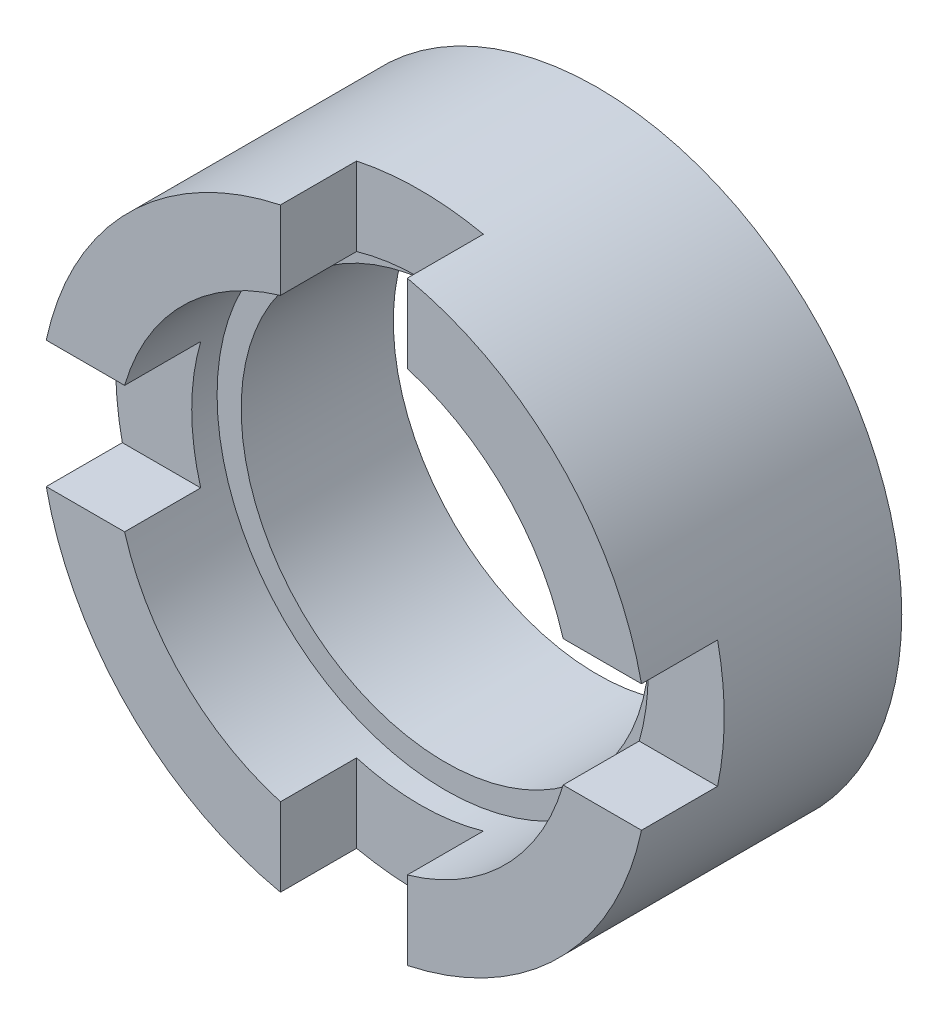
ISO-10303-21;
HEADER;
FILE_DESCRIPTION(('STEP AP214'),'2;1');
FILE_NAME('part.step','',(''),(''),'','','');
FILE_SCHEMA(('AUTOMOTIVE_DESIGN { 1 0 10303 214 1 1 1 1 }'));
ENDSEC;
DATA;
#1=APPLICATION_CONTEXT('core data for automotive mechanical design processes');
#2=APPLICATION_PROTOCOL_DEFINITION('international standard','automotive_design',2000,#1);
#3=PRODUCT_CONTEXT('',#1,'mechanical');
#4=PRODUCT('Part','Part','',(#3));
#5=PRODUCT_RELATED_PRODUCT_CATEGORY('part','',(#4));
#6=PRODUCT_DEFINITION_FORMATION('','',#4);
#7=PRODUCT_DEFINITION_CONTEXT('part definition',#1,'design');
#8=PRODUCT_DEFINITION('design','',#6,#7);
#9=PRODUCT_DEFINITION_SHAPE('','',#8);
#10=(LENGTH_UNIT() NAMED_UNIT(*) SI_UNIT(.MILLI.,.METRE.));
#11=(NAMED_UNIT(*) PLANE_ANGLE_UNIT() SI_UNIT($,.RADIAN.));
#12=(NAMED_UNIT(*) SI_UNIT($,.STERADIAN.) SOLID_ANGLE_UNIT());
#13=UNCERTAINTY_MEASURE_WITH_UNIT(LENGTH_MEASURE(1.E-05),#10,'distance_accuracy_value','');
#14=(GEOMETRIC_REPRESENTATION_CONTEXT(3) GLOBAL_UNCERTAINTY_ASSIGNED_CONTEXT((#13)) GLOBAL_UNIT_ASSIGNED_CONTEXT((#10,
#11,#12)) REPRESENTATION_CONTEXT('',''));
#15=CARTESIAN_POINT('',(0.,0.,0.));
#16=DIRECTION('',(0.,0.,1.));
#17=DIRECTION('',(1.,0.,0.));
#18=AXIS2_PLACEMENT_3D('',#15,#16,#17);
#19=CARTESIAN_POINT('',(0.,0.,10.));
#20=DIRECTION('',(0.,0.,-1.));
#21=DIRECTION('',(-1.,0.,0.));
#22=AXIS2_PLACEMENT_3D('',#19,#20,#21);
#23=CYLINDRICAL_SURFACE('',#22,8.05);
#24=CARTESIAN_POINT('',(0.,0.,0.));
#25=DIRECTION('',(0.,0.,1.));
#26=DIRECTION('',(1.,0.,0.));
#27=AXIS2_PLACEMENT_3D('',#24,#25,#26);
#28=CIRCLE('',#27,8.05);
#29=CARTESIAN_POINT('',(8.05,0.,0.));
#30=VERTEX_POINT('',#29);
#31=EDGE_CURVE('E222',#30,#30,#28,.T.);
#32=ORIENTED_EDGE('',*,*,#31,.F.);
#33=EDGE_LOOP('',(#32));
#34=FACE_BOUND('',#33,.T.);
#35=CARTESIAN_POINT('',(0.,0.,6.));
#36=DIRECTION('',(0.,0.,1.));
#37=DIRECTION('',(1.,0.,0.));
#38=AXIS2_PLACEMENT_3D('',#35,#36,#37);
#39=CIRCLE('',#38,8.05);
#40=CARTESIAN_POINT('',(8.05,0.,6.));
#41=VERTEX_POINT('',#40);
#42=EDGE_CURVE('E47',#41,#41,#39,.T.);
#43=ORIENTED_EDGE('',*,*,#42,.T.);
#44=EDGE_LOOP('',(#43));
#45=FACE_BOUND('',#44,.T.);
#46=ADVANCED_FACE('F43',(#34,#45),#23,.F.);
#47=CARTESIAN_POINT('',(0.,0.,10.));
#48=DIRECTION('',(0.,0.,1.));
#49=DIRECTION('',(1.,0.,0.));
#50=AXIS2_PLACEMENT_3D('',#47,#48,#49);
#51=PLANE('',#50);
#52=CARTESIAN_POINT('',(0.,0.,10.));
#53=DIRECTION('',(0.,0.,1.));
#54=DIRECTION('',(1.,0.,0.));
#55=AXIS2_PLACEMENT_3D('',#52,#53,#54);
#56=CIRCLE('',#55,9.);
#57=CARTESIAN_POINT('',(-2.5,8.64580823289529,10.));
#58=VERTEX_POINT('',#57);
#59=CARTESIAN_POINT('',(-8.64580823289529,2.5,10.));
#60=VERTEX_POINT('',#59);
#61=EDGE_CURVE('E176',#58,#60,#56,.T.);
#62=ORIENTED_EDGE('',*,*,#61,.F.);
#63=DIRECTION('',(0.,-1.,0.));
#64=VECTOR('',#63,1.);
#65=CARTESIAN_POINT('',(-2.5,16.5,10.));
#66=LINE('',#65,#64);
#67=CARTESIAN_POINT('',(-2.5,11.7366945943055,10.));
#68=VERTEX_POINT('',#67);
#69=EDGE_CURVE('E184',#68,#58,#66,.T.);
#70=ORIENTED_EDGE('',*,*,#69,.F.);
#71=CARTESIAN_POINT('',(0.,0.,10.));
#72=DIRECTION('',(0.,0.,1.));
#73=DIRECTION('',(1.,0.,0.));
#74=AXIS2_PLACEMENT_3D('',#71,#72,#73);
#75=CIRCLE('',#74,12.);
#76=CARTESIAN_POINT('',(-11.7366945943055,2.5,10.));
#77=VERTEX_POINT('',#76);
#78=EDGE_CURVE('E227',#68,#77,#75,.T.);
#79=ORIENTED_EDGE('',*,*,#78,.T.);
#80=DIRECTION('',(-1.,0.,0.));
#81=VECTOR('',#80,1.);
#82=CARTESIAN_POINT('',(-16.5,2.5,10.));
#83=LINE('',#82,#81);
#84=EDGE_CURVE('E192',#60,#77,#83,.T.);
#85=ORIENTED_EDGE('',*,*,#84,.F.);
#86=EDGE_LOOP('',(#62,#70,#79,#85));
#87=FACE_BOUND('',#86,.T.);
#88=ADVANCED_FACE('F249',(#87),#51,.T.);
#89=CARTESIAN_POINT('',(8.64580823289529,2.5,10.));
#90=VERTEX_POINT('',#89);
#91=CARTESIAN_POINT('',(2.5,8.64580823289529,10.));
#92=VERTEX_POINT('',#91);
#93=EDGE_CURVE('E158',#90,#92,#56,.T.);
#94=ORIENTED_EDGE('',*,*,#93,.F.);
#95=DIRECTION('',(-1.,0.,0.));
#96=VECTOR('',#95,1.);
#97=CARTESIAN_POINT('',(2.5,2.5,10.));
#98=LINE('',#97,#96);
#99=CARTESIAN_POINT('',(11.7366945943055,2.5,10.));
#100=VERTEX_POINT('',#99);
#101=EDGE_CURVE('E172',#100,#90,#98,.T.);
#102=ORIENTED_EDGE('',*,*,#101,.F.);
#103=CARTESIAN_POINT('',(2.5,11.7366945943055,10.));
#104=VERTEX_POINT('',#103);
#105=EDGE_CURVE('E52',#100,#104,#75,.T.);
#106=ORIENTED_EDGE('',*,*,#105,.T.);
#107=DIRECTION('',(0.,1.,0.));
#108=VECTOR('',#107,1.);
#109=CARTESIAN_POINT('',(2.5,16.5,10.));
#110=LINE('',#109,#108);
#111=EDGE_CURVE('E174',#92,#104,#110,.T.);
#112=ORIENTED_EDGE('',*,*,#111,.F.);
#113=EDGE_LOOP('',(#94,#102,#106,#112));
#114=FACE_BOUND('',#113,.T.);
#115=ADVANCED_FACE('F170',(#114),#51,.T.);
#116=CARTESIAN_POINT('',(2.5,-8.64580823289529,10.));
#117=VERTEX_POINT('',#116);
#118=CARTESIAN_POINT('',(8.64580823289529,-2.5,10.));
#119=VERTEX_POINT('',#118);
#120=EDGE_CURVE('E178',#117,#119,#56,.T.);
#121=ORIENTED_EDGE('',*,*,#120,.F.);
#122=DIRECTION('',(0.,1.,0.));
#123=VECTOR('',#122,1.);
#124=CARTESIAN_POINT('',(2.5,-2.5,10.));
#125=LINE('',#124,#123);
#126=CARTESIAN_POINT('',(2.50000000000001,-11.7366945943055,10.));
#127=VERTEX_POINT('',#126);
#128=EDGE_CURVE('E186',#127,#117,#125,.T.);
#129=ORIENTED_EDGE('',*,*,#128,.F.);
#130=CARTESIAN_POINT('',(11.7366945943055,-2.5,10.));
#131=VERTEX_POINT('',#130);
#132=EDGE_CURVE('E228',#127,#131,#75,.T.);
#133=ORIENTED_EDGE('',*,*,#132,.T.);
#134=DIRECTION('',(1.,0.,0.));
#135=VECTOR('',#134,1.);
#136=CARTESIAN_POINT('',(2.5,-2.5,10.));
#137=LINE('',#136,#135);
#138=EDGE_CURVE('E182',#119,#131,#137,.T.);
#139=ORIENTED_EDGE('',*,*,#138,.F.);
#140=EDGE_LOOP('',(#121,#129,#133,#139));
#141=FACE_BOUND('',#140,.T.);
#142=ADVANCED_FACE('F306',(#141),#51,.T.);
#143=CARTESIAN_POINT('',(-8.64580823289529,-2.5,10.));
#144=VERTEX_POINT('',#143);
#145=CARTESIAN_POINT('',(-2.5,-8.64580823289529,10.));
#146=VERTEX_POINT('',#145);
#147=EDGE_CURVE('E386',#144,#146,#56,.T.);
#148=ORIENTED_EDGE('',*,*,#147,.F.);
#149=DIRECTION('',(1.,0.,0.));
#150=VECTOR('',#149,1.);
#151=CARTESIAN_POINT('',(-16.5,-2.5,10.));
#152=LINE('',#151,#150);
#153=CARTESIAN_POINT('',(-11.7366945943055,-2.5,10.));
#154=VERTEX_POINT('',#153);
#155=EDGE_CURVE('E297',#154,#144,#152,.T.);
#156=ORIENTED_EDGE('',*,*,#155,.F.);
#157=CARTESIAN_POINT('',(-2.5,-11.7366945943055,10.));
#158=VERTEX_POINT('',#157);
#159=EDGE_CURVE('E233',#154,#158,#75,.T.);
#160=ORIENTED_EDGE('',*,*,#159,.T.);
#161=DIRECTION('',(0.,-1.,0.));
#162=VECTOR('',#161,1.);
#163=CARTESIAN_POINT('',(-2.5,-2.5,10.));
#164=LINE('',#163,#162);
#165=EDGE_CURVE('E300',#146,#158,#164,.T.);
#166=ORIENTED_EDGE('',*,*,#165,.F.);
#167=EDGE_LOOP('',(#148,#156,#160,#166));
#168=FACE_BOUND('',#167,.T.);
#169=ADVANCED_FACE('F345',(#168),#51,.T.);
#170=CARTESIAN_POINT('',(0.,0.,0.));
#171=DIRECTION('',(0.,0.,1.));
#172=DIRECTION('',(1.,0.,0.));
#173=AXIS2_PLACEMENT_3D('',#170,#171,#172);
#174=PLANE('',#173);
#175=CARTESIAN_POINT('',(0.,0.,0.));
#176=DIRECTION('',(0.,0.,1.));
#177=DIRECTION('',(1.,0.,0.));
#178=AXIS2_PLACEMENT_3D('',#175,#176,#177);
#179=CIRCLE('',#178,12.);
#180=CARTESIAN_POINT('',(12.,0.,0.));
#181=VERTEX_POINT('',#180);
#182=EDGE_CURVE('E225',#181,#181,#179,.T.);
#183=ORIENTED_EDGE('',*,*,#182,.F.);
#184=EDGE_LOOP('',(#183));
#185=FACE_BOUND('',#184,.T.);
#186=ORIENTED_EDGE('',*,*,#31,.T.);
#187=EDGE_LOOP('',(#186));
#188=FACE_BOUND('',#187,.T.);
#189=ADVANCED_FACE('F352',(#185,#188),#174,.F.);
#190=CARTESIAN_POINT('',(0.,0.,10.));
#191=DIRECTION('',(0.,0.,-1.));
#192=DIRECTION('',(-1.,0.,0.));
#193=AXIS2_PLACEMENT_3D('',#190,#191,#192);
#194=CYLINDRICAL_SURFACE('',#193,12.);
#195=ORIENTED_EDGE('',*,*,#78,.F.);
#196=DIRECTION('',(0.,0.,-1.));
#197=VECTOR('',#196,1.);
#198=CARTESIAN_POINT('',(-2.5,11.7366945943055,10.));
#199=LINE('',#198,#197);
#200=CARTESIAN_POINT('',(-2.5,11.7366945943055,7.));
#201=VERTEX_POINT('',#200);
#202=EDGE_CURVE('E216',#68,#201,#199,.T.);
#203=ORIENTED_EDGE('',*,*,#202,.T.);
#204=CARTESIAN_POINT('',(0.,0.,7.));
#205=DIRECTION('',(0.,0.,1.));
#206=DIRECTION('',(1.,0.,0.));
#207=AXIS2_PLACEMENT_3D('',#204,#205,#206);
#208=CIRCLE('',#207,12.);
#209=CARTESIAN_POINT('',(2.5,11.7366945943055,7.));
#210=VERTEX_POINT('',#209);
#211=EDGE_CURVE('E199',#210,#201,#208,.T.);
#212=ORIENTED_EDGE('',*,*,#211,.F.);
#213=DIRECTION('',(0.,0.,-1.));
#214=VECTOR('',#213,1.);
#215=CARTESIAN_POINT('',(2.5,11.7366945943055,10.));
#216=LINE('',#215,#214);
#217=EDGE_CURVE('E213',#210,#104,#216,.F.);
#218=ORIENTED_EDGE('',*,*,#217,.T.);
#219=ORIENTED_EDGE('',*,*,#105,.F.);
#220=DIRECTION('',(0.,0.,-1.));
#221=VECTOR('',#220,1.);
#222=CARTESIAN_POINT('',(11.7366945943055,2.5,10.));
#223=LINE('',#222,#221);
#224=CARTESIAN_POINT('',(11.7366945943055,2.5,7.));
#225=VERTEX_POINT('',#224);
#226=EDGE_CURVE('E181',#100,#225,#223,.T.);
#227=ORIENTED_EDGE('',*,*,#226,.T.);
#228=CARTESIAN_POINT('',(11.7366945943055,-2.5,7.));
#229=VERTEX_POINT('',#228);
#230=EDGE_CURVE('E195',#229,#225,#208,.T.);
#231=ORIENTED_EDGE('',*,*,#230,.F.);
#232=DIRECTION('',(0.,0.,-1.));
#233=VECTOR('',#232,1.);
#234=CARTESIAN_POINT('',(11.7366945943055,-2.5,10.));
#235=LINE('',#234,#233);
#236=EDGE_CURVE('E209',#229,#131,#235,.F.);
#237=ORIENTED_EDGE('',*,*,#236,.T.);
#238=ORIENTED_EDGE('',*,*,#132,.F.);
#239=DIRECTION('',(0.,0.,-1.));
#240=VECTOR('',#239,1.);
#241=CARTESIAN_POINT('',(2.50000000000001,-11.7366945943055,10.));
#242=LINE('',#241,#240);
#243=CARTESIAN_POINT('',(2.50000000000001,-11.7366945943055,7.));
#244=VERTEX_POINT('',#243);
#245=EDGE_CURVE('E206',#127,#244,#242,.T.);
#246=ORIENTED_EDGE('',*,*,#245,.T.);
#247=CARTESIAN_POINT('',(-2.5,-11.7366945943055,7.));
#248=VERTEX_POINT('',#247);
#249=EDGE_CURVE('E197',#248,#244,#208,.T.);
#250=ORIENTED_EDGE('',*,*,#249,.F.);
#251=DIRECTION('',(0.,0.,-1.));
#252=VECTOR('',#251,1.);
#253=CARTESIAN_POINT('',(-2.5,-11.7366945943055,10.));
#254=LINE('',#253,#252);
#255=EDGE_CURVE('E203',#248,#158,#254,.F.);
#256=ORIENTED_EDGE('',*,*,#255,.T.);
#257=ORIENTED_EDGE('',*,*,#159,.F.);
#258=DIRECTION('',(0.,0.,-1.));
#259=VECTOR('',#258,1.);
#260=CARTESIAN_POINT('',(-11.7366945943055,-2.5,10.));
#261=LINE('',#260,#259);
#262=CARTESIAN_POINT('',(-11.7366945943055,-2.5,7.));
#263=VERTEX_POINT('',#262);
#264=EDGE_CURVE('E200',#154,#263,#261,.T.);
#265=ORIENTED_EDGE('',*,*,#264,.T.);
#266=CARTESIAN_POINT('',(-11.7366945943055,2.5,7.));
#267=VERTEX_POINT('',#266);
#268=EDGE_CURVE('E66',#267,#263,#208,.T.);
#269=ORIENTED_EDGE('',*,*,#268,.F.);
#270=DIRECTION('',(0.,0.,-1.));
#271=VECTOR('',#270,1.);
#272=CARTESIAN_POINT('',(-11.7366945943055,2.5,10.));
#273=LINE('',#272,#271);
#274=EDGE_CURVE('E219',#267,#77,#273,.F.);
#275=ORIENTED_EDGE('',*,*,#274,.T.);
#276=EDGE_LOOP('',(#195,#203,#212,#218,#219,#227,#231,#237,#238,#246,#250,#256,#257,#265,#269,#275));
#277=FACE_BOUND('',#276,.T.);
#278=ORIENTED_EDGE('',*,*,#182,.T.);
#279=EDGE_LOOP('',(#278));
#280=FACE_BOUND('',#279,.T.);
#281=ADVANCED_FACE('F45',(#277,#280),#194,.T.);
#282=CARTESIAN_POINT('',(0.,0.,7.));
#283=DIRECTION('',(0.,0.,1.));
#284=DIRECTION('',(1.,0.,0.));
#285=AXIS2_PLACEMENT_3D('',#282,#283,#284);
#286=PLANE('',#285);
#287=CARTESIAN_POINT('',(0.,0.,7.));
#288=DIRECTION('',(0.,0.,1.));
#289=DIRECTION('',(1.,0.,0.));
#290=AXIS2_PLACEMENT_3D('',#287,#288,#289);
#291=CIRCLE('',#290,9.);
#292=CARTESIAN_POINT('',(8.64580823289529,-2.5,7.));
#293=VERTEX_POINT('',#292);
#294=CARTESIAN_POINT('',(8.64580823289529,2.5,7.));
#295=VERTEX_POINT('',#294);
#296=EDGE_CURVE('E160',#293,#295,#291,.T.);
#297=ORIENTED_EDGE('',*,*,#296,.F.);
#298=DIRECTION('',(1.,0.,0.));
#299=VECTOR('',#298,1.);
#300=CARTESIAN_POINT('',(2.5,-2.5,7.));
#301=LINE('',#300,#299);
#302=EDGE_CURVE('E287',#293,#229,#301,.T.);
#303=ORIENTED_EDGE('',*,*,#302,.T.);
#304=ORIENTED_EDGE('',*,*,#230,.T.);
#305=DIRECTION('',(-1.,0.,0.));
#306=VECTOR('',#305,1.);
#307=CARTESIAN_POINT('',(2.5,2.5,7.));
#308=LINE('',#307,#306);
#309=EDGE_CURVE('E289',#225,#295,#308,.T.);
#310=ORIENTED_EDGE('',*,*,#309,.T.);
#311=EDGE_LOOP('',(#297,#303,#304,#310));
#312=FACE_BOUND('',#311,.T.);
#313=ADVANCED_FACE('F314',(#312),#286,.T.);
#314=CARTESIAN_POINT('',(2.5,-2.5,7.));
#315=DIRECTION('',(0.,-1.,0.));
#316=DIRECTION('',(0.,0.,-1.));
#317=AXIS2_PLACEMENT_3D('',#314,#315,#316);
#318=PLANE('',#317);
#319=ORIENTED_EDGE('',*,*,#302,.F.);
#320=DIRECTION('',(0.,0.,1.));
#321=VECTOR('',#320,1.);
#322=CARTESIAN_POINT('',(8.64580823289529,-2.5,6.));
#323=LINE('',#322,#321);
#324=EDGE_CURVE('E278',#293,#119,#323,.T.);
#325=ORIENTED_EDGE('',*,*,#324,.T.);
#326=ORIENTED_EDGE('',*,*,#138,.T.);
#327=ORIENTED_EDGE('',*,*,#236,.F.);
#328=EDGE_LOOP('',(#319,#325,#326,#327));
#329=FACE_BOUND('',#328,.T.);
#330=ADVANCED_FACE('F312',(#329),#318,.F.);
#331=CARTESIAN_POINT('',(2.5,2.5,7.));
#332=DIRECTION('',(0.,1.,0.));
#333=DIRECTION('',(-1.,0.,0.));
#334=AXIS2_PLACEMENT_3D('',#331,#332,#333);
#335=PLANE('',#334);
#336=ORIENTED_EDGE('',*,*,#101,.T.);
#337=DIRECTION('',(0.,0.,1.));
#338=VECTOR('',#337,1.);
#339=CARTESIAN_POINT('',(8.64580823289529,2.5,6.));
#340=LINE('',#339,#338);
#341=EDGE_CURVE('E155',#90,#295,#340,.F.);
#342=ORIENTED_EDGE('',*,*,#341,.T.);
#343=ORIENTED_EDGE('',*,*,#309,.F.);
#344=ORIENTED_EDGE('',*,*,#226,.F.);
#345=EDGE_LOOP('',(#336,#342,#343,#344));
#346=FACE_BOUND('',#345,.T.);
#347=ADVANCED_FACE('F179',(#346),#335,.F.);
#348=CARTESIAN_POINT('',(0.,0.,7.));
#349=DIRECTION('',(0.,0.,1.));
#350=DIRECTION('',(1.,0.,0.));
#351=AXIS2_PLACEMENT_3D('',#348,#349,#350);
#352=CIRCLE('',#351,9.);
#353=CARTESIAN_POINT('',(-2.5,-8.64580823289529,7.));
#354=VERTEX_POINT('',#353);
#355=CARTESIAN_POINT('',(2.5,-8.64580823289529,7.));
#356=VERTEX_POINT('',#355);
#357=EDGE_CURVE('E273',#354,#356,#352,.T.);
#358=ORIENTED_EDGE('',*,*,#357,.F.);
#359=DIRECTION('',(0.,-1.,0.));
#360=VECTOR('',#359,1.);
#361=CARTESIAN_POINT('',(-2.5,-2.5,7.));
#362=LINE('',#361,#360);
#363=EDGE_CURVE('E282',#354,#248,#362,.T.);
#364=ORIENTED_EDGE('',*,*,#363,.T.);
#365=ORIENTED_EDGE('',*,*,#249,.T.);
#366=DIRECTION('',(0.,1.,0.));
#367=VECTOR('',#366,1.);
#368=CARTESIAN_POINT('',(2.5,-2.5,7.));
#369=LINE('',#368,#367);
#370=EDGE_CURVE('E284',#244,#356,#369,.T.);
#371=ORIENTED_EDGE('',*,*,#370,.T.);
#372=EDGE_LOOP('',(#358,#364,#365,#371));
#373=FACE_BOUND('',#372,.T.);
#374=ADVANCED_FACE('F362',(#373),#286,.T.);
#375=CARTESIAN_POINT('',(-2.5,-2.5,7.));
#376=DIRECTION('',(-1.,0.,0.));
#377=DIRECTION('',(0.,-1.,0.));
#378=AXIS2_PLACEMENT_3D('',#375,#376,#377);
#379=PLANE('',#378);
#380=ORIENTED_EDGE('',*,*,#363,.F.);
#381=DIRECTION('',(0.,0.,1.));
#382=VECTOR('',#381,1.);
#383=CARTESIAN_POINT('',(-2.5,-8.64580823289529,6.));
#384=LINE('',#383,#382);
#385=EDGE_CURVE('E165',#354,#146,#384,.T.);
#386=ORIENTED_EDGE('',*,*,#385,.T.);
#387=ORIENTED_EDGE('',*,*,#165,.T.);
#388=ORIENTED_EDGE('',*,*,#255,.F.);
#389=EDGE_LOOP('',(#380,#386,#387,#388));
#390=FACE_BOUND('',#389,.T.);
#391=ADVANCED_FACE('F369',(#390),#379,.F.);
#392=CARTESIAN_POINT('',(2.5,-2.5,7.));
#393=DIRECTION('',(1.,0.,0.));
#394=DIRECTION('',(0.,1.,0.));
#395=AXIS2_PLACEMENT_3D('',#392,#393,#394);
#396=PLANE('',#395);
#397=ORIENTED_EDGE('',*,*,#128,.T.);
#398=DIRECTION('',(0.,0.,1.));
#399=VECTOR('',#398,1.);
#400=CARTESIAN_POINT('',(2.5,-8.64580823289529,6.));
#401=LINE('',#400,#399);
#402=EDGE_CURVE('E270',#117,#356,#401,.F.);
#403=ORIENTED_EDGE('',*,*,#402,.T.);
#404=ORIENTED_EDGE('',*,*,#370,.F.);
#405=ORIENTED_EDGE('',*,*,#245,.F.);
#406=EDGE_LOOP('',(#397,#403,#404,#405));
#407=FACE_BOUND('',#406,.T.);
#408=ADVANCED_FACE('F303',(#407),#396,.F.);
#409=CARTESIAN_POINT('',(0.,0.,7.));
#410=DIRECTION('',(0.,0.,1.));
#411=DIRECTION('',(1.,0.,0.));
#412=AXIS2_PLACEMENT_3D('',#409,#410,#411);
#413=CIRCLE('',#412,9.);
#414=CARTESIAN_POINT('',(-8.64580823289529,2.5,7.));
#415=VERTEX_POINT('',#414);
#416=CARTESIAN_POINT('',(-8.64580823289529,-2.5,7.));
#417=VERTEX_POINT('',#416);
#418=EDGE_CURVE('E259',#415,#417,#413,.T.);
#419=ORIENTED_EDGE('',*,*,#418,.F.);
#420=DIRECTION('',(-1.,0.,0.));
#421=VECTOR('',#420,1.);
#422=CARTESIAN_POINT('',(-16.5,2.5,7.));
#423=LINE('',#422,#421);
#424=EDGE_CURVE('E198',#415,#267,#423,.T.);
#425=ORIENTED_EDGE('',*,*,#424,.T.);
#426=ORIENTED_EDGE('',*,*,#268,.T.);
#427=DIRECTION('',(1.,0.,0.));
#428=VECTOR('',#427,1.);
#429=CARTESIAN_POINT('',(-16.5,-2.5,7.));
#430=LINE('',#429,#428);
#431=EDGE_CURVE('E194',#263,#417,#430,.T.);
#432=ORIENTED_EDGE('',*,*,#431,.T.);
#433=EDGE_LOOP('',(#419,#425,#426,#432));
#434=FACE_BOUND('',#433,.T.);
#435=ADVANCED_FACE('F336',(#434),#286,.T.);
#436=CARTESIAN_POINT('',(-16.5,-2.5,7.));
#437=DIRECTION('',(0.,-1.,0.));
#438=DIRECTION('',(1.,0.,0.));
#439=AXIS2_PLACEMENT_3D('',#436,#437,#438);
#440=PLANE('',#439);
#441=ORIENTED_EDGE('',*,*,#155,.T.);
#442=DIRECTION('',(0.,0.,1.));
#443=VECTOR('',#442,1.);
#444=CARTESIAN_POINT('',(-8.64580823289529,-2.5,6.));
#445=LINE('',#444,#443);
#446=EDGE_CURVE('E262',#144,#417,#445,.F.);
#447=ORIENTED_EDGE('',*,*,#446,.T.);
#448=ORIENTED_EDGE('',*,*,#431,.F.);
#449=ORIENTED_EDGE('',*,*,#264,.F.);
#450=EDGE_LOOP('',(#441,#447,#448,#449));
#451=FACE_BOUND('',#450,.T.);
#452=ADVANCED_FACE('F349',(#451),#440,.F.);
#453=CARTESIAN_POINT('',(-16.5,2.5,7.));
#454=DIRECTION('',(0.,1.,0.));
#455=DIRECTION('',(-1.,0.,0.));
#456=AXIS2_PLACEMENT_3D('',#453,#454,#455);
#457=PLANE('',#456);
#458=ORIENTED_EDGE('',*,*,#424,.F.);
#459=DIRECTION('',(0.,0.,1.));
#460=VECTOR('',#459,1.);
#461=CARTESIAN_POINT('',(-8.64580823289529,2.5,6.));
#462=LINE('',#461,#460);
#463=EDGE_CURVE('E257',#415,#60,#462,.T.);
#464=ORIENTED_EDGE('',*,*,#463,.T.);
#465=ORIENTED_EDGE('',*,*,#84,.T.);
#466=ORIENTED_EDGE('',*,*,#274,.F.);
#467=EDGE_LOOP('',(#458,#464,#465,#466));
#468=FACE_BOUND('',#467,.T.);
#469=ADVANCED_FACE('F255',(#468),#457,.F.);
#470=CARTESIAN_POINT('',(-2.5,16.5,7.));
#471=DIRECTION('',(-1.,0.,0.));
#472=DIRECTION('',(0.,-1.,0.));
#473=AXIS2_PLACEMENT_3D('',#470,#471,#472);
#474=PLANE('',#473);
#475=ORIENTED_EDGE('',*,*,#69,.T.);
#476=DIRECTION('',(0.,0.,1.));
#477=VECTOR('',#476,1.);
#478=CARTESIAN_POINT('',(-2.5,8.64580823289529,6.));
#479=LINE('',#478,#477);
#480=CARTESIAN_POINT('',(-2.5,8.64580823289529,7.));
#481=VERTEX_POINT('',#480);
#482=EDGE_CURVE('E260',#58,#481,#479,.F.);
#483=ORIENTED_EDGE('',*,*,#482,.T.);
#484=DIRECTION('',(0.,-1.,0.));
#485=VECTOR('',#484,1.);
#486=CARTESIAN_POINT('',(-2.5,16.5,7.));
#487=LINE('',#486,#485);
#488=EDGE_CURVE('E293',#201,#481,#487,.T.);
#489=ORIENTED_EDGE('',*,*,#488,.F.);
#490=ORIENTED_EDGE('',*,*,#202,.F.);
#491=EDGE_LOOP('',(#475,#483,#489,#490));
#492=FACE_BOUND('',#491,.T.);
#493=ADVANCED_FACE('F391',(#492),#474,.F.);
#494=CARTESIAN_POINT('',(2.5,16.5,7.));
#495=DIRECTION('',(1.,0.,0.));
#496=DIRECTION('',(0.,1.,0.));
#497=AXIS2_PLACEMENT_3D('',#494,#495,#496);
#498=PLANE('',#497);
#499=DIRECTION('',(0.,1.,0.));
#500=VECTOR('',#499,1.);
#501=CARTESIAN_POINT('',(2.5,16.5,7.));
#502=LINE('',#501,#500);
#503=CARTESIAN_POINT('',(2.5,8.64580823289529,7.));
#504=VERTEX_POINT('',#503);
#505=EDGE_CURVE('E291',#504,#210,#502,.T.);
#506=ORIENTED_EDGE('',*,*,#505,.F.);
#507=DIRECTION('',(0.,0.,1.));
#508=VECTOR('',#507,1.);
#509=CARTESIAN_POINT('',(2.5,8.64580823289529,6.));
#510=LINE('',#509,#508);
#511=EDGE_CURVE('E58',#504,#92,#510,.T.);
#512=ORIENTED_EDGE('',*,*,#511,.T.);
#513=ORIENTED_EDGE('',*,*,#111,.T.);
#514=ORIENTED_EDGE('',*,*,#217,.F.);
#515=EDGE_LOOP('',(#506,#512,#513,#514));
#516=FACE_BOUND('',#515,.T.);
#517=ADVANCED_FACE('F318',(#516),#498,.F.);
#518=CARTESIAN_POINT('',(0.,0.,7.));
#519=DIRECTION('',(0.,0.,1.));
#520=DIRECTION('',(1.,0.,0.));
#521=AXIS2_PLACEMENT_3D('',#518,#519,#520);
#522=CIRCLE('',#521,9.);
#523=EDGE_CURVE('E11',#504,#481,#522,.T.);
#524=ORIENTED_EDGE('',*,*,#523,.F.);
#525=ORIENTED_EDGE('',*,*,#505,.T.);
#526=ORIENTED_EDGE('',*,*,#211,.T.);
#527=ORIENTED_EDGE('',*,*,#488,.T.);
#528=EDGE_LOOP('',(#524,#525,#526,#527));
#529=FACE_BOUND('',#528,.T.);
#530=ADVANCED_FACE('F326',(#529),#286,.T.);
#531=CARTESIAN_POINT('',(0.,0.,6.));
#532=DIRECTION('',(0.,0.,1.));
#533=DIRECTION('',(1.,0.,0.));
#534=AXIS2_PLACEMENT_3D('',#531,#532,#533);
#535=CYLINDRICAL_SURFACE('',#534,9.);
#536=CARTESIAN_POINT('',(0.,0.,6.));
#537=DIRECTION('',(0.,0.,1.));
#538=DIRECTION('',(1.,0.,0.));
#539=AXIS2_PLACEMENT_3D('',#536,#537,#538);
#540=CIRCLE('',#539,9.);
#541=CARTESIAN_POINT('',(9.,0.,6.));
#542=VERTEX_POINT('',#541);
#543=EDGE_CURVE('E175',#542,#542,#540,.T.);
#544=ORIENTED_EDGE('',*,*,#543,.F.);
#545=EDGE_LOOP('',(#544));
#546=FACE_BOUND('',#545,.T.);
#547=ORIENTED_EDGE('',*,*,#296,.T.);
#548=ORIENTED_EDGE('',*,*,#341,.F.);
#549=ORIENTED_EDGE('',*,*,#93,.T.);
#550=ORIENTED_EDGE('',*,*,#511,.F.);
#551=ORIENTED_EDGE('',*,*,#523,.T.);
#552=ORIENTED_EDGE('',*,*,#482,.F.);
#553=ORIENTED_EDGE('',*,*,#61,.T.);
#554=ORIENTED_EDGE('',*,*,#463,.F.);
#555=ORIENTED_EDGE('',*,*,#418,.T.);
#556=ORIENTED_EDGE('',*,*,#446,.F.);
#557=ORIENTED_EDGE('',*,*,#147,.T.);
#558=ORIENTED_EDGE('',*,*,#385,.F.);
#559=ORIENTED_EDGE('',*,*,#357,.T.);
#560=ORIENTED_EDGE('',*,*,#402,.F.);
#561=ORIENTED_EDGE('',*,*,#120,.T.);
#562=ORIENTED_EDGE('',*,*,#324,.F.);
#563=EDGE_LOOP('',(#547,#548,#549,#550,#551,#552,#553,#554,#555,#556,#557,#558,#559,#560,#561,#562));
#564=FACE_BOUND('',#563,.T.);
#565=ADVANCED_FACE('F157',(#546,#564),#535,.F.);
#566=CARTESIAN_POINT('',(0.,0.,6.));
#567=DIRECTION('',(0.,0.,1.));
#568=DIRECTION('',(1.,0.,0.));
#569=AXIS2_PLACEMENT_3D('',#566,#567,#568);
#570=PLANE('',#569);
#571=ORIENTED_EDGE('',*,*,#42,.F.);
#572=EDGE_LOOP('',(#571));
#573=FACE_BOUND('',#572,.T.);
#574=ORIENTED_EDGE('',*,*,#543,.T.);
#575=EDGE_LOOP('',(#574));
#576=FACE_BOUND('',#575,.T.);
#577=ADVANCED_FACE('F323',(#573,#576),#570,.T.);
#578=CLOSED_SHELL('',(#46,#88,#115,#142,#169,#189,#281,#313,#330,#347,#374,#391,#408,#435,#452,
#469,#493,#517,#530,#565,#577));
#579=MANIFOLD_SOLID_BREP('B2',#578);
#580=ADVANCED_BREP_SHAPE_REPRESENTATION('',(#18,#579),#14);
#581=SHAPE_DEFINITION_REPRESENTATION(#9,#580);
ENDSEC;
END-ISO-10303-21;
